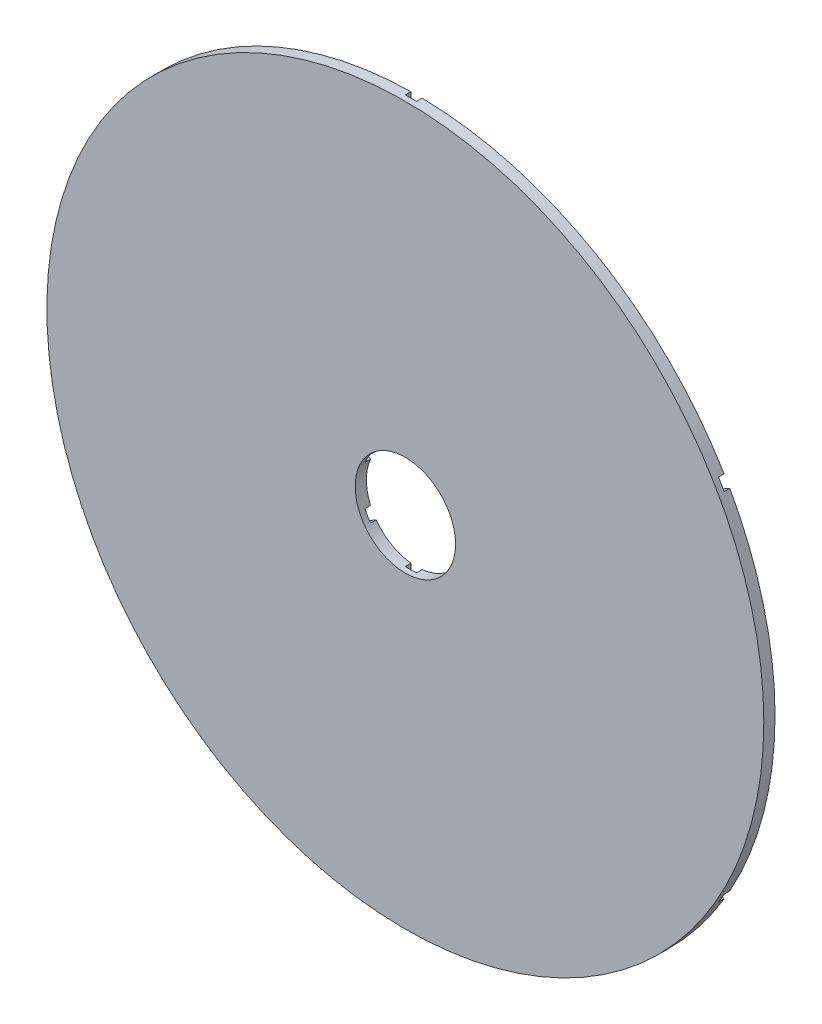
ISO-10303-21;
HEADER;
FILE_DESCRIPTION(('STEP AP214'),'2;1');
FILE_NAME('part.step','',(''),(''),'','','');
FILE_SCHEMA(('AUTOMOTIVE_DESIGN { 1 0 10303 214 1 1 1 1 }'));
ENDSEC;
DATA;
#1=APPLICATION_CONTEXT('core data for automotive mechanical design processes');
#2=APPLICATION_PROTOCOL_DEFINITION('international standard','automotive_design',2000,#1);
#3=PRODUCT_CONTEXT('',#1,'mechanical');
#4=PRODUCT('Part','Part','',(#3));
#5=PRODUCT_RELATED_PRODUCT_CATEGORY('part','',(#4));
#6=PRODUCT_DEFINITION_FORMATION('','',#4);
#7=PRODUCT_DEFINITION_CONTEXT('part definition',#1,'design');
#8=PRODUCT_DEFINITION('design','',#6,#7);
#9=PRODUCT_DEFINITION_SHAPE('','',#8);
#10=(LENGTH_UNIT() NAMED_UNIT(*) SI_UNIT(.MILLI.,.METRE.));
#11=(NAMED_UNIT(*) PLANE_ANGLE_UNIT() SI_UNIT($,.RADIAN.));
#12=(NAMED_UNIT(*) SI_UNIT($,.STERADIAN.) SOLID_ANGLE_UNIT());
#13=UNCERTAINTY_MEASURE_WITH_UNIT(LENGTH_MEASURE(1.E-05),#10,'distance_accuracy_value','');
#14=(GEOMETRIC_REPRESENTATION_CONTEXT(3) GLOBAL_UNCERTAINTY_ASSIGNED_CONTEXT((#13)) GLOBAL_UNIT_ASSIGNED_CONTEXT((#10,
#11,#12)) REPRESENTATION_CONTEXT('',''));
#15=CARTESIAN_POINT('',(0.,0.,0.));
#16=DIRECTION('',(0.,0.,1.));
#17=DIRECTION('',(1.,0.,0.));
#18=AXIS2_PLACEMENT_3D('',#15,#16,#17);
#19=CARTESIAN_POINT('',(0.,0.,1.5875));
#20=DIRECTION('',(0.,0.,-1.));
#21=DIRECTION('',(-1.,0.,0.));
#22=AXIS2_PLACEMENT_3D('',#19,#20,#21);
#23=PLANE('',#22);
#24=CARTESIAN_POINT('',(0.,0.,1.5875));
#25=DIRECTION('',(0.,0.,-1.));
#26=DIRECTION('',(-1.,0.,0.));
#27=AXIS2_PLACEMENT_3D('',#24,#25,#26);
#28=CIRCLE('',#27,14.224);
#29=CARTESIAN_POINT('',(-13.0351353306108,5.69275178737508,1.5875));
#30=VERTEX_POINT('',#29);
#31=CARTESIAN_POINT('',(-11.4476353306107,8.4423824443906,1.5875));
#32=VERTEX_POINT('',#31);
#33=EDGE_CURVE('E11',#30,#32,#28,.T.);
#34=ORIENTED_EDGE('',*,*,#33,.F.);
#35=DIRECTION('',(-0.866025403784436,0.500000000000005,0.));
#36=VECTOR('',#35,1.);
#37=CARTESIAN_POINT('',(-0.793749999999706,-1.37481532850727,1.5875));
#38=LINE('',#37,#36);
#39=CARTESIAN_POINT('',(-88.7711896241013,49.4189831210826,1.5875));
#40=VERTEX_POINT('',#39);
#41=EDGE_CURVE('E155',#30,#40,#38,.T.);
#42=ORIENTED_EDGE('',*,*,#41,.T.);
#43=CARTESIAN_POINT('',(0.,0.,1.5875));
#44=DIRECTION('',(0.,0.,-1.));
#45=DIRECTION('',(-1.,0.,0.));
#46=AXIS2_PLACEMENT_3D('',#43,#44,#45);
#47=CIRCLE('',#46,101.6);
#48=CARTESIAN_POINT('',(-87.1836896241013,52.1686137780981,1.5875));
#49=VERTEX_POINT('',#48);
#50=EDGE_CURVE('E201',#40,#49,#47,.T.);
#51=ORIENTED_EDGE('',*,*,#50,.T.);
#52=DIRECTION('',(-0.866025403784436,0.500000000000005,0.));
#53=VECTOR('',#52,1.);
#54=CARTESIAN_POINT('',(0.793750000000313,1.37481532850832,1.5875));
#55=LINE('',#54,#53);
#56=EDGE_CURVE('E58',#32,#49,#55,.T.);
#57=ORIENTED_EDGE('',*,*,#56,.F.);
#58=EDGE_LOOP('',(#34,#42,#51,#57));
#59=FACE_BOUND('',#58,.T.);
#60=ADVANCED_FACE('F33',(#59),#23,.T.);
#61=CARTESIAN_POINT('',(-1.5875,14.1351342317645,1.5875));
#62=VERTEX_POINT('',#61);
#63=CARTESIAN_POINT('',(1.5875,14.1351342317645,1.5875));
#64=VERTEX_POINT('',#63);
#65=EDGE_CURVE('E42',#62,#64,#28,.T.);
#66=ORIENTED_EDGE('',*,*,#65,.F.);
#67=DIRECTION('',(0.,1.,0.));
#68=VECTOR('',#67,1.);
#69=CARTESIAN_POINT('',(-1.5875,0.,1.5875));
#70=LINE('',#69,#68);
#71=CARTESIAN_POINT('',(-1.5875,101.587596899179,1.5875));
#72=VERTEX_POINT('',#71);
#73=EDGE_CURVE('E113',#62,#72,#70,.T.);
#74=ORIENTED_EDGE('',*,*,#73,.T.);
#75=CARTESIAN_POINT('',(0.,0.,1.5875));
#76=DIRECTION('',(0.,0.,-1.));
#77=DIRECTION('',(-1.,0.,0.));
#78=AXIS2_PLACEMENT_3D('',#75,#76,#77);
#79=CIRCLE('',#78,101.6);
#80=CARTESIAN_POINT('',(1.5875,101.587596899179,1.5875));
#81=VERTEX_POINT('',#80);
#82=EDGE_CURVE('E250',#72,#81,#79,.T.);
#83=ORIENTED_EDGE('',*,*,#82,.T.);
#84=DIRECTION('',(0.,1.,0.));
#85=VECTOR('',#84,1.);
#86=CARTESIAN_POINT('',(1.5875,0.,1.5875));
#87=LINE('',#86,#85);
#88=EDGE_CURVE('E257',#64,#81,#87,.T.);
#89=ORIENTED_EDGE('',*,*,#88,.F.);
#90=EDGE_LOOP('',(#66,#74,#83,#89));
#91=FACE_BOUND('',#90,.T.);
#92=ADVANCED_FACE('F403',(#91),#23,.T.);
#93=CARTESIAN_POINT('',(11.4476353306107,8.4423824443906,1.5875));
#94=VERTEX_POINT('',#93);
#95=CARTESIAN_POINT('',(13.0351353306108,5.69275178737508,1.5875));
#96=VERTEX_POINT('',#95);
#97=EDGE_CURVE('E334',#94,#96,#28,.T.);
#98=ORIENTED_EDGE('',*,*,#97,.F.);
#99=DIRECTION('',(0.866025403784436,0.500000000000005,0.));
#100=VECTOR('',#99,1.);
#101=CARTESIAN_POINT('',(-0.793750000000313,1.37481532850832,1.5875));
#102=LINE('',#101,#100);
#103=CARTESIAN_POINT('',(87.1836896241013,52.1686137780981,1.5875));
#104=VERTEX_POINT('',#103);
#105=EDGE_CURVE('E259',#94,#104,#102,.T.);
#106=ORIENTED_EDGE('',*,*,#105,.T.);
#107=CARTESIAN_POINT('',(0.,0.,1.5875));
#108=DIRECTION('',(0.,0.,-1.));
#109=DIRECTION('',(-1.,0.,0.));
#110=AXIS2_PLACEMENT_3D('',#107,#108,#109);
#111=CIRCLE('',#110,101.6);
#112=CARTESIAN_POINT('',(88.7711896241013,49.4189831210826,1.5875));
#113=VERTEX_POINT('',#112);
#114=EDGE_CURVE('E261',#104,#113,#111,.T.);
#115=ORIENTED_EDGE('',*,*,#114,.T.);
#116=DIRECTION('',(0.866025403784436,0.500000000000005,0.));
#117=VECTOR('',#116,1.);
#118=CARTESIAN_POINT('',(0.793749999999706,-1.37481532850727,1.5875));
#119=LINE('',#118,#117);
#120=EDGE_CURVE('E264',#96,#113,#119,.T.);
#121=ORIENTED_EDGE('',*,*,#120,.F.);
#122=EDGE_LOOP('',(#98,#106,#115,#121));
#123=FACE_BOUND('',#122,.T.);
#124=ADVANCED_FACE('F407',(#123),#23,.T.);
#125=CARTESIAN_POINT('',(13.0351353306113,-5.69275178737396,1.5875));
#126=VERTEX_POINT('',#125);
#127=CARTESIAN_POINT('',(11.4476353306114,-8.44238244438962,1.5875));
#128=VERTEX_POINT('',#127);
#129=EDGE_CURVE('E332',#126,#128,#28,.T.);
#130=ORIENTED_EDGE('',*,*,#129,.F.);
#131=DIRECTION('',(-0.866025403784436,0.500000000000005,0.));
#132=VECTOR('',#131,1.);
#133=CARTESIAN_POINT('',(0.793750000000313,1.37481532850832,1.5875));
#134=LINE('',#133,#132);
#135=CARTESIAN_POINT('',(88.7711896241019,-49.4189831210815,1.5875));
#136=VERTEX_POINT('',#135);
#137=EDGE_CURVE('E266',#136,#126,#134,.T.);
#138=ORIENTED_EDGE('',*,*,#137,.F.);
#139=CARTESIAN_POINT('',(0.,0.,1.5875));
#140=DIRECTION('',(0.,0.,-1.));
#141=DIRECTION('',(-1.,0.,0.));
#142=AXIS2_PLACEMENT_3D('',#139,#140,#141);
#143=CIRCLE('',#142,101.6);
#144=CARTESIAN_POINT('',(87.1836896241019,-52.1686137780971,1.5875));
#145=VERTEX_POINT('',#144);
#146=EDGE_CURVE('E269',#136,#145,#143,.T.);
#147=ORIENTED_EDGE('',*,*,#146,.T.);
#148=DIRECTION('',(-0.866025403784436,0.500000000000005,0.));
#149=VECTOR('',#148,1.);
#150=CARTESIAN_POINT('',(-0.793749999999706,-1.37481532850727,1.5875));
#151=LINE('',#150,#149);
#152=EDGE_CURVE('E272',#145,#128,#151,.T.);
#153=ORIENTED_EDGE('',*,*,#152,.T.);
#154=EDGE_LOOP('',(#130,#138,#147,#153));
#155=FACE_BOUND('',#154,.T.);
#156=ADVANCED_FACE('F419',(#155),#23,.T.);
#157=CARTESIAN_POINT('',(1.5875,-14.1351342317645,1.5875));
#158=VERTEX_POINT('',#157);
#159=CARTESIAN_POINT('',(-1.5875,-14.1351342317645,1.5875));
#160=VERTEX_POINT('',#159);
#161=EDGE_CURVE('E327',#158,#160,#28,.T.);
#162=ORIENTED_EDGE('',*,*,#161,.F.);
#163=DIRECTION('',(0.,1.,0.));
#164=VECTOR('',#163,1.);
#165=CARTESIAN_POINT('',(1.5875,0.,1.5875));
#166=LINE('',#165,#164);
#167=CARTESIAN_POINT('',(1.5875,-101.587596899179,1.5875));
#168=VERTEX_POINT('',#167);
#169=EDGE_CURVE('E275',#168,#158,#166,.T.);
#170=ORIENTED_EDGE('',*,*,#169,.F.);
#171=CARTESIAN_POINT('',(0.,0.,1.5875));
#172=DIRECTION('',(0.,0.,-1.));
#173=DIRECTION('',(-1.,0.,0.));
#174=AXIS2_PLACEMENT_3D('',#171,#172,#173);
#175=CIRCLE('',#174,101.6);
#176=CARTESIAN_POINT('',(-1.5875,-101.587596899179,1.5875));
#177=VERTEX_POINT('',#176);
#178=EDGE_CURVE('E278',#168,#177,#175,.T.);
#179=ORIENTED_EDGE('',*,*,#178,.T.);
#180=DIRECTION('',(0.,1.,0.));
#181=VECTOR('',#180,1.);
#182=CARTESIAN_POINT('',(-1.5875,0.,1.5875));
#183=LINE('',#182,#181);
#184=EDGE_CURVE('E281',#177,#160,#183,.T.);
#185=ORIENTED_EDGE('',*,*,#184,.T.);
#186=EDGE_LOOP('',(#162,#170,#179,#185));
#187=FACE_BOUND('',#186,.T.);
#188=ADVANCED_FACE('F325',(#187),#23,.T.);
#189=CARTESIAN_POINT('',(0.,0.,3.175));
#190=DIRECTION('',(0.,0.,-1.));
#191=DIRECTION('',(-1.,0.,0.));
#192=AXIS2_PLACEMENT_3D('',#189,#190,#191);
#193=CYLINDRICAL_SURFACE('',#192,101.6);
#194=CARTESIAN_POINT('',(0.,0.,3.175));
#195=DIRECTION('',(0.,0.,1.));
#196=DIRECTION('',(1.,0.,0.));
#197=AXIS2_PLACEMENT_3D('',#194,#195,#196);
#198=CIRCLE('',#197,101.6);
#199=CARTESIAN_POINT('',(101.6,0.,3.175));
#200=VERTEX_POINT('',#199);
#201=EDGE_CURVE('E202',#200,#200,#198,.T.);
#202=ORIENTED_EDGE('',*,*,#201,.F.);
#203=EDGE_LOOP('',(#202));
#204=FACE_BOUND('',#203,.T.);
#205=DIRECTION('',(0.,0.,-1.));
#206=VECTOR('',#205,1.);
#207=CARTESIAN_POINT('',(-87.1836896241013,52.1686137780981,1.5875));
#208=LINE('',#207,#206);
#209=CARTESIAN_POINT('',(-87.1836896241013,52.1686137780981,0.));
#210=VERTEX_POINT('',#209);
#211=EDGE_CURVE('E174',#49,#210,#208,.T.);
#212=ORIENTED_EDGE('',*,*,#211,.F.);
#213=ORIENTED_EDGE('',*,*,#50,.F.);
#214=DIRECTION('',(0.,0.,-1.));
#215=VECTOR('',#214,1.);
#216=CARTESIAN_POINT('',(-88.7711896241013,49.4189831210826,1.5875));
#217=LINE('',#216,#215);
#218=CARTESIAN_POINT('',(-88.7711896241013,49.4189831210826,0.));
#219=VERTEX_POINT('',#218);
#220=EDGE_CURVE('E171',#40,#219,#217,.T.);
#221=ORIENTED_EDGE('',*,*,#220,.T.);
#222=CARTESIAN_POINT('',(0.,0.,0.));
#223=DIRECTION('',(0.,0.,1.));
#224=DIRECTION('',(1.,0.,0.));
#225=AXIS2_PLACEMENT_3D('',#222,#223,#224);
#226=CIRCLE('',#225,101.6);
#227=CARTESIAN_POINT('',(-88.7711896241019,-49.4189831210815,0.));
#228=VERTEX_POINT('',#227);
#229=EDGE_CURVE('E170',#219,#228,#226,.T.);
#230=ORIENTED_EDGE('',*,*,#229,.T.);
#231=DIRECTION('',(0.,0.,-1.));
#232=VECTOR('',#231,1.);
#233=CARTESIAN_POINT('',(-88.7711896241019,-49.4189831210815,1.5875));
#234=LINE('',#233,#232);
#235=CARTESIAN_POINT('',(-88.7711896241019,-49.4189831210815,1.5875));
#236=VERTEX_POINT('',#235);
#237=EDGE_CURVE('E149',#236,#228,#234,.T.);
#238=ORIENTED_EDGE('',*,*,#237,.F.);
#239=CARTESIAN_POINT('',(0.,0.,1.5875));
#240=DIRECTION('',(0.,0.,-1.));
#241=DIRECTION('',(-1.,0.,0.));
#242=AXIS2_PLACEMENT_3D('',#239,#240,#241);
#243=CIRCLE('',#242,101.6);
#244=CARTESIAN_POINT('',(-87.1836896241019,-52.1686137780971,1.5875));
#245=VERTEX_POINT('',#244);
#246=EDGE_CURVE('E156',#245,#236,#243,.T.);
#247=ORIENTED_EDGE('',*,*,#246,.F.);
#248=DIRECTION('',(0.,0.,-1.));
#249=VECTOR('',#248,1.);
#250=CARTESIAN_POINT('',(-87.1836896241019,-52.1686137780971,1.5875));
#251=LINE('',#250,#249);
#252=CARTESIAN_POINT('',(-87.1836896241019,-52.1686137780971,0.));
#253=VERTEX_POINT('',#252);
#254=EDGE_CURVE('E172',#245,#253,#251,.T.);
#255=ORIENTED_EDGE('',*,*,#254,.T.);
#256=CARTESIAN_POINT('',(-1.5875,-101.587596899179,0.));
#257=VERTEX_POINT('',#256);
#258=EDGE_CURVE('E211',#253,#257,#226,.T.);
#259=ORIENTED_EDGE('',*,*,#258,.T.);
#260=DIRECTION('',(0.,0.,-1.));
#261=VECTOR('',#260,1.);
#262=CARTESIAN_POINT('',(-1.5875,-101.587596899179,1.5875));
#263=LINE('',#262,#261);
#264=EDGE_CURVE('E176',#177,#257,#263,.T.);
#265=ORIENTED_EDGE('',*,*,#264,.F.);
#266=ORIENTED_EDGE('',*,*,#178,.F.);
#267=DIRECTION('',(0.,0.,-1.));
#268=VECTOR('',#267,1.);
#269=CARTESIAN_POINT('',(1.5875,-101.587596899179,1.5875));
#270=LINE('',#269,#268);
#271=CARTESIAN_POINT('',(1.5875,-101.587596899179,0.));
#272=VERTEX_POINT('',#271);
#273=EDGE_CURVE('E181',#168,#272,#270,.T.);
#274=ORIENTED_EDGE('',*,*,#273,.T.);
#275=CARTESIAN_POINT('',(87.1836896241019,-52.1686137780971,0.));
#276=VERTEX_POINT('',#275);
#277=EDGE_CURVE('E207',#272,#276,#226,.T.);
#278=ORIENTED_EDGE('',*,*,#277,.T.);
#279=DIRECTION('',(0.,0.,-1.));
#280=VECTOR('',#279,1.);
#281=CARTESIAN_POINT('',(87.1836896241019,-52.1686137780971,1.5875));
#282=LINE('',#281,#280);
#283=EDGE_CURVE('E184',#145,#276,#282,.T.);
#284=ORIENTED_EDGE('',*,*,#283,.F.);
#285=ORIENTED_EDGE('',*,*,#146,.F.);
#286=DIRECTION('',(0.,0.,-1.));
#287=VECTOR('',#286,1.);
#288=CARTESIAN_POINT('',(88.7711896241019,-49.4189831210815,1.5875));
#289=LINE('',#288,#287);
#290=CARTESIAN_POINT('',(88.7711896241019,-49.4189831210815,0.));
#291=VERTEX_POINT('',#290);
#292=EDGE_CURVE('E186',#136,#291,#289,.T.);
#293=ORIENTED_EDGE('',*,*,#292,.T.);
#294=CARTESIAN_POINT('',(88.7711896241013,49.4189831210826,0.));
#295=VERTEX_POINT('',#294);
#296=EDGE_CURVE('E205',#291,#295,#226,.T.);
#297=ORIENTED_EDGE('',*,*,#296,.T.);
#298=DIRECTION('',(0.,0.,-1.));
#299=VECTOR('',#298,1.);
#300=CARTESIAN_POINT('',(88.7711896241013,49.4189831210826,1.5875));
#301=LINE('',#300,#299);
#302=EDGE_CURVE('E189',#113,#295,#301,.T.);
#303=ORIENTED_EDGE('',*,*,#302,.F.);
#304=ORIENTED_EDGE('',*,*,#114,.F.);
#305=DIRECTION('',(0.,0.,-1.));
#306=VECTOR('',#305,1.);
#307=CARTESIAN_POINT('',(87.1836896241013,52.1686137780981,1.5875));
#308=LINE('',#307,#306);
#309=CARTESIAN_POINT('',(87.1836896241013,52.1686137780981,0.));
#310=VERTEX_POINT('',#309);
#311=EDGE_CURVE('E192',#104,#310,#308,.T.);
#312=ORIENTED_EDGE('',*,*,#311,.T.);
#313=CARTESIAN_POINT('',(1.5875,101.587596899179,0.));
#314=VERTEX_POINT('',#313);
#315=EDGE_CURVE('E204',#310,#314,#226,.T.);
#316=ORIENTED_EDGE('',*,*,#315,.T.);
#317=DIRECTION('',(0.,0.,-1.));
#318=VECTOR('',#317,1.);
#319=CARTESIAN_POINT('',(1.5875,101.587596899179,1.5875));
#320=LINE('',#319,#318);
#321=EDGE_CURVE('E195',#81,#314,#320,.T.);
#322=ORIENTED_EDGE('',*,*,#321,.F.);
#323=ORIENTED_EDGE('',*,*,#82,.F.);
#324=DIRECTION('',(0.,0.,-1.));
#325=VECTOR('',#324,1.);
#326=CARTESIAN_POINT('',(-1.5875,101.587596899179,1.5875));
#327=LINE('',#326,#325);
#328=CARTESIAN_POINT('',(-1.5875,101.587596899179,0.));
#329=VERTEX_POINT('',#328);
#330=EDGE_CURVE('E198',#72,#329,#327,.T.);
#331=ORIENTED_EDGE('',*,*,#330,.T.);
#332=EDGE_CURVE('E213',#329,#210,#226,.T.);
#333=ORIENTED_EDGE('',*,*,#332,.T.);
#334=EDGE_LOOP('',(#212,#213,#221,#230,#238,#247,#255,#259,#265,#266,#274,#278,#284,#285,#293,
#297,#303,#304,#312,#316,#322,#323,#331,#333));
#335=FACE_BOUND('',#334,.T.);
#336=ADVANCED_FACE('F35',(#204,#335),#193,.T.);
#337=CARTESIAN_POINT('',(0.,0.,0.));
#338=DIRECTION('',(0.,0.,1.));
#339=DIRECTION('',(1.,0.,0.));
#340=AXIS2_PLACEMENT_3D('',#337,#338,#339);
#341=PLANE('',#340);
#342=DIRECTION('',(0.866025403784436,0.500000000000005,0.));
#343=VECTOR('',#342,1.);
#344=CARTESIAN_POINT('',(0.793749999999706,-1.37481532850727,0.));
#345=LINE('',#344,#343);
#346=CARTESIAN_POINT('',(-11.4476353306114,-8.44238244438962,0.));
#347=VERTEX_POINT('',#346);
#348=EDGE_CURVE('E227',#253,#347,#345,.T.);
#349=ORIENTED_EDGE('',*,*,#348,.T.);
#350=CARTESIAN_POINT('',(0.,0.,0.));
#351=DIRECTION('',(0.,0.,1.));
#352=DIRECTION('',(1.,0.,0.));
#353=AXIS2_PLACEMENT_3D('',#350,#351,#352);
#354=CIRCLE('',#353,14.224);
#355=CARTESIAN_POINT('',(-1.5875,-14.1351342317645,0.));
#356=VERTEX_POINT('',#355);
#357=EDGE_CURVE('E231',#347,#356,#354,.T.);
#358=ORIENTED_EDGE('',*,*,#357,.T.);
#359=DIRECTION('',(0.,1.,0.));
#360=VECTOR('',#359,1.);
#361=CARTESIAN_POINT('',(-1.5875,0.,0.));
#362=LINE('',#361,#360);
#363=EDGE_CURVE('E229',#257,#356,#362,.T.);
#364=ORIENTED_EDGE('',*,*,#363,.F.);
#365=ORIENTED_EDGE('',*,*,#258,.F.);
#366=EDGE_LOOP('',(#349,#358,#364,#365));
#367=FACE_BOUND('',#366,.T.);
#368=ADVANCED_FACE('F224',(#367),#341,.F.);
#369=DIRECTION('',(0.,1.,0.));
#370=VECTOR('',#369,1.);
#371=CARTESIAN_POINT('',(1.5875,0.,0.));
#372=LINE('',#371,#370);
#373=CARTESIAN_POINT('',(1.5875,-14.1351342317645,0.));
#374=VERTEX_POINT('',#373);
#375=EDGE_CURVE('E234',#272,#374,#372,.T.);
#376=ORIENTED_EDGE('',*,*,#375,.T.);
#377=CARTESIAN_POINT('',(11.4476353306114,-8.44238244438962,0.));
#378=VERTEX_POINT('',#377);
#379=EDGE_CURVE('E316',#374,#378,#354,.T.);
#380=ORIENTED_EDGE('',*,*,#379,.T.);
#381=DIRECTION('',(-0.866025403784436,0.500000000000005,0.));
#382=VECTOR('',#381,1.);
#383=CARTESIAN_POINT('',(-0.793749999999706,-1.37481532850727,0.));
#384=LINE('',#383,#382);
#385=EDGE_CURVE('E239',#276,#378,#384,.T.);
#386=ORIENTED_EDGE('',*,*,#385,.F.);
#387=ORIENTED_EDGE('',*,*,#277,.F.);
#388=EDGE_LOOP('',(#376,#380,#386,#387));
#389=FACE_BOUND('',#388,.T.);
#390=ADVANCED_FACE('F314',(#389),#341,.F.);
#391=DIRECTION('',(-0.866025403784436,0.500000000000005,0.));
#392=VECTOR('',#391,1.);
#393=CARTESIAN_POINT('',(0.793750000000313,1.37481532850832,0.));
#394=LINE('',#393,#392);
#395=CARTESIAN_POINT('',(13.0351353306113,-5.69275178737396,0.));
#396=VERTEX_POINT('',#395);
#397=EDGE_CURVE('E296',#291,#396,#394,.T.);
#398=ORIENTED_EDGE('',*,*,#397,.T.);
#399=CARTESIAN_POINT('',(13.0351353306108,5.69275178737508,0.));
#400=VERTEX_POINT('',#399);
#401=EDGE_CURVE('E352',#396,#400,#354,.T.);
#402=ORIENTED_EDGE('',*,*,#401,.T.);
#403=DIRECTION('',(0.866025403784436,0.500000000000005,0.));
#404=VECTOR('',#403,1.);
#405=CARTESIAN_POINT('',(0.793749999999706,-1.37481532850727,0.));
#406=LINE('',#405,#404);
#407=EDGE_CURVE('E294',#400,#295,#406,.T.);
#408=ORIENTED_EDGE('',*,*,#407,.T.);
#409=ORIENTED_EDGE('',*,*,#296,.F.);
#410=EDGE_LOOP('',(#398,#402,#408,#409));
#411=FACE_BOUND('',#410,.T.);
#412=ADVANCED_FACE('F438',(#411),#341,.F.);
#413=DIRECTION('',(-0.866025403784436,0.500000000000005,0.));
#414=VECTOR('',#413,1.);
#415=CARTESIAN_POINT('',(-0.793749999999706,-1.37481532850727,0.));
#416=LINE('',#415,#414);
#417=CARTESIAN_POINT('',(-13.0351353306108,5.69275178737508,0.));
#418=VERTEX_POINT('',#417);
#419=EDGE_CURVE('E244',#418,#219,#416,.T.);
#420=ORIENTED_EDGE('',*,*,#419,.F.);
#421=CARTESIAN_POINT('',(-13.0351353306113,-5.69275178737396,0.));
#422=VERTEX_POINT('',#421);
#423=EDGE_CURVE('E386',#418,#422,#354,.T.);
#424=ORIENTED_EDGE('',*,*,#423,.T.);
#425=DIRECTION('',(0.866025403784436,0.500000000000005,0.));
#426=VECTOR('',#425,1.);
#427=CARTESIAN_POINT('',(-0.793750000000313,1.37481532850832,0.));
#428=LINE('',#427,#426);
#429=EDGE_CURVE('E236',#228,#422,#428,.T.);
#430=ORIENTED_EDGE('',*,*,#429,.F.);
#431=ORIENTED_EDGE('',*,*,#229,.F.);
#432=EDGE_LOOP('',(#420,#424,#430,#431));
#433=FACE_BOUND('',#432,.T.);
#434=ADVANCED_FACE('F494',(#433),#341,.F.);
#435=DIRECTION('',(0.,1.,0.));
#436=VECTOR('',#435,1.);
#437=CARTESIAN_POINT('',(-1.5875,0.,0.));
#438=LINE('',#437,#436);
#439=CARTESIAN_POINT('',(-1.5875,14.1351342317645,0.));
#440=VERTEX_POINT('',#439);
#441=EDGE_CURVE('E288',#440,#329,#438,.T.);
#442=ORIENTED_EDGE('',*,*,#441,.F.);
#443=CARTESIAN_POINT('',(-11.4476353306107,8.4423824443906,0.));
#444=VERTEX_POINT('',#443);
#445=EDGE_CURVE('E350',#440,#444,#354,.T.);
#446=ORIENTED_EDGE('',*,*,#445,.T.);
#447=DIRECTION('',(-0.866025403784436,0.500000000000005,0.));
#448=VECTOR('',#447,1.);
#449=CARTESIAN_POINT('',(0.793750000000313,1.37481532850832,0.));
#450=LINE('',#449,#448);
#451=EDGE_CURVE('E105',#444,#210,#450,.T.);
#452=ORIENTED_EDGE('',*,*,#451,.T.);
#453=ORIENTED_EDGE('',*,*,#332,.F.);
#454=EDGE_LOOP('',(#442,#446,#452,#453));
#455=FACE_BOUND('',#454,.T.);
#456=ADVANCED_FACE('F385',(#455),#341,.F.);
#457=CARTESIAN_POINT('',(0.,0.,3.175));
#458=DIRECTION('',(0.,0.,1.));
#459=DIRECTION('',(1.,0.,0.));
#460=AXIS2_PLACEMENT_3D('',#457,#458,#459);
#461=PLANE('',#460);
#462=CARTESIAN_POINT('',(0.,0.,3.175));
#463=DIRECTION('',(0.,0.,1.));
#464=DIRECTION('',(1.,0.,0.));
#465=AXIS2_PLACEMENT_3D('',#462,#463,#464);
#466=CIRCLE('',#465,14.224);
#467=CARTESIAN_POINT('',(14.224,0.,3.175));
#468=VERTEX_POINT('',#467);
#469=EDGE_CURVE('E354',#468,#468,#466,.T.);
#470=ORIENTED_EDGE('',*,*,#469,.F.);
#471=EDGE_LOOP('',(#470));
#472=FACE_BOUND('',#471,.T.);
#473=ORIENTED_EDGE('',*,*,#201,.T.);
#474=EDGE_LOOP('',(#473));
#475=FACE_BOUND('',#474,.T.);
#476=ADVANCED_FACE('F485',(#472,#475),#461,.T.);
#477=DIRECTION('',(0.866025403784436,0.500000000000005,0.));
#478=VECTOR('',#477,1.);
#479=CARTESIAN_POINT('',(-0.793750000000313,1.37481532850832,0.));
#480=LINE('',#479,#478);
#481=CARTESIAN_POINT('',(11.4476353306107,8.4423824443906,0.));
#482=VERTEX_POINT('',#481);
#483=EDGE_CURVE('E292',#482,#310,#480,.T.);
#484=ORIENTED_EDGE('',*,*,#483,.F.);
#485=CARTESIAN_POINT('',(1.5875,14.1351342317645,0.));
#486=VERTEX_POINT('',#485);
#487=EDGE_CURVE('E345',#482,#486,#354,.T.);
#488=ORIENTED_EDGE('',*,*,#487,.T.);
#489=DIRECTION('',(0.,1.,0.));
#490=VECTOR('',#489,1.);
#491=CARTESIAN_POINT('',(1.5875,0.,0.));
#492=LINE('',#491,#490);
#493=EDGE_CURVE('E290',#486,#314,#492,.T.);
#494=ORIENTED_EDGE('',*,*,#493,.T.);
#495=ORIENTED_EDGE('',*,*,#315,.F.);
#496=EDGE_LOOP('',(#484,#488,#494,#495));
#497=FACE_BOUND('',#496,.T.);
#498=ADVANCED_FACE('F399',(#497),#341,.F.);
#499=CARTESIAN_POINT('',(0.793750000000313,1.37481532850832,1.5875));
#500=DIRECTION('',(-0.500000000000005,-0.866025403784436,0.));
#501=DIRECTION('',(0.866025403784436,-0.500000000000005,0.));
#502=AXIS2_PLACEMENT_3D('',#499,#500,#501);
#503=PLANE('',#502);
#504=DIRECTION('',(0.,0.,1.));
#505=VECTOR('',#504,1.);
#506=CARTESIAN_POINT('',(-11.4476353306107,8.4423824443906,0.));
#507=LINE('',#506,#505);
#508=EDGE_CURVE('E253',#32,#444,#507,.F.);
#509=ORIENTED_EDGE('',*,*,#508,.F.);
#510=ORIENTED_EDGE('',*,*,#56,.T.);
#511=ORIENTED_EDGE('',*,*,#211,.T.);
#512=ORIENTED_EDGE('',*,*,#451,.F.);
#513=EDGE_LOOP('',(#509,#510,#511,#512));
#514=FACE_BOUND('',#513,.T.);
#515=ADVANCED_FACE('F387',(#514),#503,.T.);
#516=CARTESIAN_POINT('',(-0.793749999999706,-1.37481532850727,1.5875));
#517=DIRECTION('',(-0.500000000000005,-0.866025403784436,0.));
#518=DIRECTION('',(0.866025403784436,-0.500000000000005,0.));
#519=AXIS2_PLACEMENT_3D('',#516,#517,#518);
#520=PLANE('',#519);
#521=ORIENTED_EDGE('',*,*,#41,.F.);
#522=DIRECTION('',(0.,0.,1.));
#523=VECTOR('',#522,1.);
#524=CARTESIAN_POINT('',(-13.0351353306108,5.69275178737508,0.));
#525=LINE('',#524,#523);
#526=EDGE_CURVE('E374',#30,#418,#525,.F.);
#527=ORIENTED_EDGE('',*,*,#526,.T.);
#528=ORIENTED_EDGE('',*,*,#419,.T.);
#529=ORIENTED_EDGE('',*,*,#220,.F.);
#530=EDGE_LOOP('',(#521,#527,#528,#529));
#531=FACE_BOUND('',#530,.T.);
#532=ADVANCED_FACE('F391',(#531),#520,.F.);
#533=CARTESIAN_POINT('',(-0.793750000000313,1.37481532850832,1.5875));
#534=DIRECTION('',(-0.500000000000005,0.866025403784436,0.));
#535=DIRECTION('',(-0.866025403784436,-0.500000000000005,0.));
#536=AXIS2_PLACEMENT_3D('',#533,#534,#535);
#537=PLANE('',#536);
#538=ORIENTED_EDGE('',*,*,#429,.T.);
#539=DIRECTION('',(0.,0.,1.));
#540=VECTOR('',#539,1.);
#541=CARTESIAN_POINT('',(-13.0351353306113,-5.69275178737396,0.));
#542=LINE('',#541,#540);
#543=CARTESIAN_POINT('',(-13.0351353306113,-5.69275178737396,1.5875));
#544=VERTEX_POINT('',#543);
#545=EDGE_CURVE('E153',#422,#544,#542,.T.);
#546=ORIENTED_EDGE('',*,*,#545,.T.);
#547=DIRECTION('',(0.866025403784436,0.500000000000005,0.));
#548=VECTOR('',#547,1.);
#549=CARTESIAN_POINT('',(-0.793750000000313,1.37481532850832,1.5875));
#550=LINE('',#549,#548);
#551=EDGE_CURVE('E144',#236,#544,#550,.T.);
#552=ORIENTED_EDGE('',*,*,#551,.F.);
#553=ORIENTED_EDGE('',*,*,#237,.T.);
#554=EDGE_LOOP('',(#538,#546,#552,#553));
#555=FACE_BOUND('',#554,.T.);
#556=ADVANCED_FACE('F147',(#555),#537,.F.);
#557=CARTESIAN_POINT('',(0.793749999999706,-1.37481532850727,1.5875));
#558=DIRECTION('',(-0.500000000000005,0.866025403784436,0.));
#559=DIRECTION('',(-0.866025403784436,-0.500000000000005,0.));
#560=AXIS2_PLACEMENT_3D('',#557,#558,#559);
#561=PLANE('',#560);
#562=DIRECTION('',(0.,0.,1.));
#563=VECTOR('',#562,1.);
#564=CARTESIAN_POINT('',(-11.4476353306114,-8.44238244438962,0.));
#565=LINE('',#564,#563);
#566=CARTESIAN_POINT('',(-11.4476353306114,-8.44238244438962,1.5875));
#567=VERTEX_POINT('',#566);
#568=EDGE_CURVE('E49',#347,#567,#565,.T.);
#569=ORIENTED_EDGE('',*,*,#568,.F.);
#570=ORIENTED_EDGE('',*,*,#348,.F.);
#571=ORIENTED_EDGE('',*,*,#254,.F.);
#572=DIRECTION('',(0.866025403784436,0.500000000000005,0.));
#573=VECTOR('',#572,1.);
#574=CARTESIAN_POINT('',(0.793749999999706,-1.37481532850727,1.5875));
#575=LINE('',#574,#573);
#576=EDGE_CURVE('E162',#245,#567,#575,.T.);
#577=ORIENTED_EDGE('',*,*,#576,.T.);
#578=EDGE_LOOP('',(#569,#570,#571,#577));
#579=FACE_BOUND('',#578,.T.);
#580=ADVANCED_FACE('F343',(#579),#561,.T.);
#581=CARTESIAN_POINT('',(-1.5875,0.,1.5875));
#582=DIRECTION('',(-1.,0.,0.));
#583=DIRECTION('',(0.,0.,1.));
#584=AXIS2_PLACEMENT_3D('',#581,#582,#583);
#585=PLANE('',#584);
#586=ORIENTED_EDGE('',*,*,#363,.T.);
#587=DIRECTION('',(0.,0.,1.));
#588=VECTOR('',#587,1.);
#589=CARTESIAN_POINT('',(-1.5875,-14.1351342317645,0.));
#590=LINE('',#589,#588);
#591=EDGE_CURVE('E357',#356,#160,#590,.T.);
#592=ORIENTED_EDGE('',*,*,#591,.T.);
#593=ORIENTED_EDGE('',*,*,#184,.F.);
#594=ORIENTED_EDGE('',*,*,#264,.T.);
#595=EDGE_LOOP('',(#586,#592,#593,#594));
#596=FACE_BOUND('',#595,.T.);
#597=ADVANCED_FACE('F509',(#596),#585,.F.);
#598=CARTESIAN_POINT('',(1.5875,0.,1.5875));
#599=DIRECTION('',(-1.,0.,0.));
#600=DIRECTION('',(0.,0.,1.));
#601=AXIS2_PLACEMENT_3D('',#598,#599,#600);
#602=PLANE('',#601);
#603=DIRECTION('',(0.,0.,1.));
#604=VECTOR('',#603,1.);
#605=CARTESIAN_POINT('',(1.5875,-14.1351342317645,0.));
#606=LINE('',#605,#604);
#607=EDGE_CURVE('E347',#374,#158,#606,.T.);
#608=ORIENTED_EDGE('',*,*,#607,.F.);
#609=ORIENTED_EDGE('',*,*,#375,.F.);
#610=ORIENTED_EDGE('',*,*,#273,.F.);
#611=ORIENTED_EDGE('',*,*,#169,.T.);
#612=EDGE_LOOP('',(#608,#609,#610,#611));
#613=FACE_BOUND('',#612,.T.);
#614=ADVANCED_FACE('F321',(#613),#602,.T.);
#615=CARTESIAN_POINT('',(-0.793749999999706,-1.37481532850727,1.5875));
#616=DIRECTION('',(-0.500000000000005,-0.866025403784436,0.));
#617=DIRECTION('',(0.866025403784436,-0.500000000000005,0.));
#618=AXIS2_PLACEMENT_3D('',#615,#616,#617);
#619=PLANE('',#618);
#620=ORIENTED_EDGE('',*,*,#385,.T.);
#621=DIRECTION('',(0.,0.,1.));
#622=VECTOR('',#621,1.);
#623=CARTESIAN_POINT('',(11.4476353306114,-8.44238244438962,0.));
#624=LINE('',#623,#622);
#625=EDGE_CURVE('E306',#378,#128,#624,.T.);
#626=ORIENTED_EDGE('',*,*,#625,.T.);
#627=ORIENTED_EDGE('',*,*,#152,.F.);
#628=ORIENTED_EDGE('',*,*,#283,.T.);
#629=EDGE_LOOP('',(#620,#626,#627,#628));
#630=FACE_BOUND('',#629,.T.);
#631=ADVANCED_FACE('F303',(#630),#619,.F.);
#632=CARTESIAN_POINT('',(0.793750000000313,1.37481532850832,1.5875));
#633=DIRECTION('',(-0.500000000000005,-0.866025403784436,0.));
#634=DIRECTION('',(0.866025403784436,-0.500000000000005,0.));
#635=AXIS2_PLACEMENT_3D('',#632,#633,#634);
#636=PLANE('',#635);
#637=DIRECTION('',(0.,0.,1.));
#638=VECTOR('',#637,1.);
#639=CARTESIAN_POINT('',(13.0351353306113,-5.69275178737396,0.));
#640=LINE('',#639,#638);
#641=EDGE_CURVE('E359',#396,#126,#640,.T.);
#642=ORIENTED_EDGE('',*,*,#641,.F.);
#643=ORIENTED_EDGE('',*,*,#397,.F.);
#644=ORIENTED_EDGE('',*,*,#292,.F.);
#645=ORIENTED_EDGE('',*,*,#137,.T.);
#646=EDGE_LOOP('',(#642,#643,#644,#645));
#647=FACE_BOUND('',#646,.T.);
#648=ADVANCED_FACE('F436',(#647),#636,.T.);
#649=CARTESIAN_POINT('',(0.793749999999706,-1.37481532850727,1.5875));
#650=DIRECTION('',(-0.500000000000005,0.866025403784436,0.));
#651=DIRECTION('',(-0.866025403784436,-0.500000000000005,0.));
#652=AXIS2_PLACEMENT_3D('',#649,#650,#651);
#653=PLANE('',#652);
#654=DIRECTION('',(0.,0.,1.));
#655=VECTOR('',#654,1.);
#656=CARTESIAN_POINT('',(13.0351353306108,5.69275178737508,0.));
#657=LINE('',#656,#655);
#658=EDGE_CURVE('E366',#96,#400,#657,.F.);
#659=ORIENTED_EDGE('',*,*,#658,.F.);
#660=ORIENTED_EDGE('',*,*,#120,.T.);
#661=ORIENTED_EDGE('',*,*,#302,.T.);
#662=ORIENTED_EDGE('',*,*,#407,.F.);
#663=EDGE_LOOP('',(#659,#660,#661,#662));
#664=FACE_BOUND('',#663,.T.);
#665=ADVANCED_FACE('F445',(#664),#653,.T.);
#666=CARTESIAN_POINT('',(-0.793750000000313,1.37481532850832,1.5875));
#667=DIRECTION('',(-0.500000000000005,0.866025403784436,0.));
#668=DIRECTION('',(-0.866025403784436,-0.500000000000005,0.));
#669=AXIS2_PLACEMENT_3D('',#666,#667,#668);
#670=PLANE('',#669);
#671=ORIENTED_EDGE('',*,*,#105,.F.);
#672=DIRECTION('',(0.,0.,1.));
#673=VECTOR('',#672,1.);
#674=CARTESIAN_POINT('',(11.4476353306107,8.4423824443906,0.));
#675=LINE('',#674,#673);
#676=EDGE_CURVE('E363',#94,#482,#675,.F.);
#677=ORIENTED_EDGE('',*,*,#676,.T.);
#678=ORIENTED_EDGE('',*,*,#483,.T.);
#679=ORIENTED_EDGE('',*,*,#311,.F.);
#680=EDGE_LOOP('',(#671,#677,#678,#679));
#681=FACE_BOUND('',#680,.T.);
#682=ADVANCED_FACE('F455',(#681),#670,.F.);
#683=CARTESIAN_POINT('',(1.5875,0.,1.5875));
#684=DIRECTION('',(-1.,0.,0.));
#685=DIRECTION('',(0.,0.,1.));
#686=AXIS2_PLACEMENT_3D('',#683,#684,#685);
#687=PLANE('',#686);
#688=DIRECTION('',(0.,0.,1.));
#689=VECTOR('',#688,1.);
#690=CARTESIAN_POINT('',(1.5875,14.1351342317645,0.));
#691=LINE('',#690,#689);
#692=EDGE_CURVE('E372',#64,#486,#691,.F.);
#693=ORIENTED_EDGE('',*,*,#692,.F.);
#694=ORIENTED_EDGE('',*,*,#88,.T.);
#695=ORIENTED_EDGE('',*,*,#321,.T.);
#696=ORIENTED_EDGE('',*,*,#493,.F.);
#697=EDGE_LOOP('',(#693,#694,#695,#696));
#698=FACE_BOUND('',#697,.T.);
#699=ADVANCED_FACE('F415',(#698),#687,.T.);
#700=CARTESIAN_POINT('',(-1.5875,0.,1.5875));
#701=DIRECTION('',(-1.,0.,0.));
#702=DIRECTION('',(0.,0.,1.));
#703=AXIS2_PLACEMENT_3D('',#700,#701,#702);
#704=PLANE('',#703);
#705=ORIENTED_EDGE('',*,*,#73,.F.);
#706=DIRECTION('',(0.,0.,1.));
#707=VECTOR('',#706,1.);
#708=CARTESIAN_POINT('',(-1.5875,14.1351342317645,0.));
#709=LINE('',#708,#707);
#710=EDGE_CURVE('E369',#62,#440,#709,.F.);
#711=ORIENTED_EDGE('',*,*,#710,.T.);
#712=ORIENTED_EDGE('',*,*,#441,.T.);
#713=ORIENTED_EDGE('',*,*,#330,.F.);
#714=EDGE_LOOP('',(#705,#711,#712,#713));
#715=FACE_BOUND('',#714,.T.);
#716=ADVANCED_FACE('F410',(#715),#704,.F.);
#717=EDGE_CURVE('E37',#567,#544,#28,.T.);
#718=ORIENTED_EDGE('',*,*,#717,.F.);
#719=ORIENTED_EDGE('',*,*,#576,.F.);
#720=ORIENTED_EDGE('',*,*,#246,.T.);
#721=ORIENTED_EDGE('',*,*,#551,.T.);
#722=EDGE_LOOP('',(#718,#719,#720,#721));
#723=FACE_BOUND('',#722,.T.);
#724=ADVANCED_FACE('F160',(#723),#23,.T.);
#725=CARTESIAN_POINT('',(0.,0.,0.));
#726=DIRECTION('',(0.,0.,1.));
#727=DIRECTION('',(1.,0.,0.));
#728=AXIS2_PLACEMENT_3D('',#725,#726,#727);
#729=CYLINDRICAL_SURFACE('',#728,14.224);
#730=ORIENTED_EDGE('',*,*,#508,.T.);
#731=ORIENTED_EDGE('',*,*,#445,.F.);
#732=ORIENTED_EDGE('',*,*,#710,.F.);
#733=ORIENTED_EDGE('',*,*,#65,.T.);
#734=ORIENTED_EDGE('',*,*,#692,.T.);
#735=ORIENTED_EDGE('',*,*,#487,.F.);
#736=ORIENTED_EDGE('',*,*,#676,.F.);
#737=ORIENTED_EDGE('',*,*,#97,.T.);
#738=ORIENTED_EDGE('',*,*,#658,.T.);
#739=ORIENTED_EDGE('',*,*,#401,.F.);
#740=ORIENTED_EDGE('',*,*,#641,.T.);
#741=ORIENTED_EDGE('',*,*,#129,.T.);
#742=ORIENTED_EDGE('',*,*,#625,.F.);
#743=ORIENTED_EDGE('',*,*,#379,.F.);
#744=ORIENTED_EDGE('',*,*,#607,.T.);
#745=ORIENTED_EDGE('',*,*,#161,.T.);
#746=ORIENTED_EDGE('',*,*,#591,.F.);
#747=ORIENTED_EDGE('',*,*,#357,.F.);
#748=ORIENTED_EDGE('',*,*,#568,.T.);
#749=ORIENTED_EDGE('',*,*,#717,.T.);
#750=ORIENTED_EDGE('',*,*,#545,.F.);
#751=ORIENTED_EDGE('',*,*,#423,.F.);
#752=ORIENTED_EDGE('',*,*,#526,.F.);
#753=ORIENTED_EDGE('',*,*,#33,.T.);
#754=EDGE_LOOP('',(#730,#731,#732,#733,#734,#735,#736,#737,#738,#739,#740,#741,#742,#743,#744,
#745,#746,#747,#748,#749,#750,#751,#752,#753));
#755=FACE_BOUND('',#754,.T.);
#756=ORIENTED_EDGE('',*,*,#469,.T.);
#757=EDGE_LOOP('',(#756));
#758=FACE_BOUND('',#757,.T.);
#759=ADVANCED_FACE('F336',(#755,#758),#729,.F.);
#760=CLOSED_SHELL('',(#60,#92,#124,#156,#188,#336,#368,#390,#412,#434,#456,#476,#498,#515,#532,
#556,#580,#597,#614,#631,#648,#665,#682,#699,#716,#724,#759));
#761=MANIFOLD_SOLID_BREP('B2',#760);
#762=ADVANCED_BREP_SHAPE_REPRESENTATION('',(#18,#761),#14);
#763=SHAPE_DEFINITION_REPRESENTATION(#9,#762);
ENDSEC;
END-ISO-10303-21;
